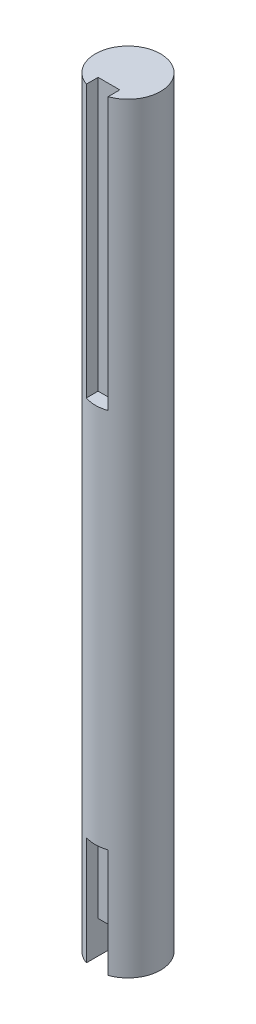
ISO-10303-21;
HEADER;
FILE_DESCRIPTION(('STEP AP214'),'2;1');
FILE_NAME('part.step','',(''),(''),'','','');
FILE_SCHEMA(('AUTOMOTIVE_DESIGN { 1 0 10303 214 1 1 1 1 }'));
ENDSEC;
DATA;
#1=APPLICATION_CONTEXT('core data for automotive mechanical design processes');
#2=APPLICATION_PROTOCOL_DEFINITION('international standard','automotive_design',2000,#1);
#3=PRODUCT_CONTEXT('',#1,'mechanical');
#4=PRODUCT('Part','Part','',(#3));
#5=PRODUCT_RELATED_PRODUCT_CATEGORY('part','',(#4));
#6=PRODUCT_DEFINITION_FORMATION('','',#4);
#7=PRODUCT_DEFINITION_CONTEXT('part definition',#1,'design');
#8=PRODUCT_DEFINITION('design','',#6,#7);
#9=PRODUCT_DEFINITION_SHAPE('','',#8);
#10=(LENGTH_UNIT() NAMED_UNIT(*) SI_UNIT(.MILLI.,.METRE.));
#11=(NAMED_UNIT(*) PLANE_ANGLE_UNIT() SI_UNIT($,.RADIAN.));
#12=(NAMED_UNIT(*) SI_UNIT($,.STERADIAN.) SOLID_ANGLE_UNIT());
#13=UNCERTAINTY_MEASURE_WITH_UNIT(LENGTH_MEASURE(1.E-05),#10,'distance_accuracy_value','');
#14=(GEOMETRIC_REPRESENTATION_CONTEXT(3) GLOBAL_UNCERTAINTY_ASSIGNED_CONTEXT((#13)) GLOBAL_UNIT_ASSIGNED_CONTEXT((#10,
#11,#12)) REPRESENTATION_CONTEXT('',''));
#15=CARTESIAN_POINT('',(0.,0.,0.));
#16=DIRECTION('',(0.,0.,1.));
#17=DIRECTION('',(1.,0.,0.));
#18=AXIS2_PLACEMENT_3D('',#15,#16,#17);
#19=CARTESIAN_POINT('',(0.,-36.,0.));
#20=DIRECTION('',(0.,1.,0.));
#21=DIRECTION('',(0.,0.,1.));
#22=AXIS2_PLACEMENT_3D('',#19,#20,#21);
#23=PLANE('',#22);
#24=DIRECTION('',(0.,0.,1.));
#25=VECTOR('',#24,1.);
#26=CARTESIAN_POINT('',(2.,-36.,0.));
#27=LINE('',#26,#25);
#28=CARTESIAN_POINT('',(2.,-36.,1.));
#29=VERTEX_POINT('',#28);
#30=CARTESIAN_POINT('',(2.,-36.,5.65685424949238));
#31=VERTEX_POINT('',#30);
#32=EDGE_CURVE('E186',#29,#31,#27,.T.);
#33=ORIENTED_EDGE('',*,*,#32,.F.);
#34=DIRECTION('',(-1.,0.,0.));
#35=VECTOR('',#34,1.);
#36=CARTESIAN_POINT('',(0.,-36.,1.));
#37=LINE('',#36,#35);
#38=CARTESIAN_POINT('',(-2.,-36.,0.999999999999999));
#39=VERTEX_POINT('',#38);
#40=EDGE_CURVE('E123',#29,#39,#37,.T.);
#41=ORIENTED_EDGE('',*,*,#40,.T.);
#42=DIRECTION('',(0.,0.,-1.));
#43=VECTOR('',#42,1.);
#44=CARTESIAN_POINT('',(-2.,-36.,0.));
#45=LINE('',#44,#43);
#46=CARTESIAN_POINT('',(-2.,-36.,5.65685424949238));
#47=VERTEX_POINT('',#46);
#48=EDGE_CURVE('E184',#47,#39,#45,.T.);
#49=ORIENTED_EDGE('',*,*,#48,.F.);
#50=CARTESIAN_POINT('',(0.,-36.,0.));
#51=DIRECTION('',(0.,1.,0.));
#52=DIRECTION('',(0.,0.,1.));
#53=AXIS2_PLACEMENT_3D('',#50,#51,#52);
#54=CIRCLE('',#53,6.);
#55=EDGE_CURVE('E181',#31,#47,#54,.T.);
#56=ORIENTED_EDGE('',*,*,#55,.F.);
#57=EDGE_LOOP('',(#33,#41,#49,#56));
#58=FACE_BOUND('',#57,.T.);
#59=ADVANCED_FACE('F38',(#58),#23,.F.);
#60=CARTESIAN_POINT('',(0.,-36.,0.));
#61=DIRECTION('',(0.,1.,0.));
#62=DIRECTION('',(0.,0.,1.));
#63=AXIS2_PLACEMENT_3D('',#60,#61,#62);
#64=CYLINDRICAL_SURFACE('',#63,6.);
#65=CARTESIAN_POINT('',(0.,-16.,0.));
#66=DIRECTION('',(0.,1.,0.));
#67=DIRECTION('',(0.,0.,1.));
#68=AXIS2_PLACEMENT_3D('',#65,#66,#67);
#69=CIRCLE('',#68,6.);
#70=CARTESIAN_POINT('',(2.,-16.,5.65685424949238));
#71=VERTEX_POINT('',#70);
#72=CARTESIAN_POINT('',(-2.,-16.,5.65685424949238));
#73=VERTEX_POINT('',#72);
#74=EDGE_CURVE('E188',#71,#73,#69,.F.);
#75=ORIENTED_EDGE('',*,*,#74,.F.);
#76=DIRECTION('',(0.,1.,0.));
#77=VECTOR('',#76,1.);
#78=CARTESIAN_POINT('',(2.,-36.,5.65685424949238));
#79=LINE('',#78,#77);
#80=EDGE_CURVE('E176',#71,#31,#79,.F.);
#81=ORIENTED_EDGE('',*,*,#80,.T.);
#82=ORIENTED_EDGE('',*,*,#55,.T.);
#83=DIRECTION('',(0.,1.,0.));
#84=VECTOR('',#83,1.);
#85=CARTESIAN_POINT('',(-2.,-36.,5.65685424949238));
#86=LINE('',#85,#84);
#87=EDGE_CURVE('E174',#47,#73,#86,.T.);
#88=ORIENTED_EDGE('',*,*,#87,.T.);
#89=EDGE_LOOP('',(#75,#81,#82,#88));
#90=FACE_BOUND('',#89,.T.);
#91=CARTESIAN_POINT('',(0.,54.,0.));
#92=DIRECTION('',(0.,-1.,0.));
#93=DIRECTION('',(0.,0.,-1.));
#94=AXIS2_PLACEMENT_3D('',#91,#92,#93);
#95=CIRCLE('',#94,6.);
#96=CARTESIAN_POINT('',(-2.,54.,5.65685424949238));
#97=VERTEX_POINT('',#96);
#98=CARTESIAN_POINT('',(2.,54.,5.65685424949238));
#99=VERTEX_POINT('',#98);
#100=EDGE_CURVE('E11',#97,#99,#95,.F.);
#101=ORIENTED_EDGE('',*,*,#100,.F.);
#102=DIRECTION('',(0.,1.,0.));
#103=VECTOR('',#102,1.);
#104=CARTESIAN_POINT('',(-2.,-36.,5.65685424949238));
#105=LINE('',#104,#103);
#106=CARTESIAN_POINT('',(-2.,104.,5.65685424949238));
#107=VERTEX_POINT('',#106);
#108=EDGE_CURVE('E160',#97,#107,#105,.T.);
#109=ORIENTED_EDGE('',*,*,#108,.T.);
#110=CARTESIAN_POINT('',(0.,104.,0.));
#111=DIRECTION('',(0.,1.,0.));
#112=DIRECTION('',(0.,0.,1.));
#113=AXIS2_PLACEMENT_3D('',#110,#111,#112);
#114=CIRCLE('',#113,6.);
#115=CARTESIAN_POINT('',(2.,104.,5.65685424949238));
#116=VERTEX_POINT('',#115);
#117=EDGE_CURVE('E178',#116,#107,#114,.T.);
#118=ORIENTED_EDGE('',*,*,#117,.F.);
#119=DIRECTION('',(0.,1.,0.));
#120=VECTOR('',#119,1.);
#121=CARTESIAN_POINT('',(2.,-36.,5.65685424949238));
#122=LINE('',#121,#120);
#123=EDGE_CURVE('E61',#116,#99,#122,.F.);
#124=ORIENTED_EDGE('',*,*,#123,.T.);
#125=EDGE_LOOP('',(#101,#109,#118,#124));
#126=FACE_BOUND('',#125,.T.);
#127=ADVANCED_FACE('F40',(#90,#126),#64,.T.);
#128=CARTESIAN_POINT('',(0.,104.,0.));
#129=DIRECTION('',(0.,1.,0.));
#130=DIRECTION('',(0.,0.,1.));
#131=AXIS2_PLACEMENT_3D('',#128,#129,#130);
#132=PLANE('',#131);
#133=ORIENTED_EDGE('',*,*,#117,.T.);
#134=DIRECTION('',(0.,0.,-1.));
#135=VECTOR('',#134,1.);
#136=CARTESIAN_POINT('',(-2.,104.,0.));
#137=LINE('',#136,#135);
#138=CARTESIAN_POINT('',(-2.,104.,3.5));
#139=VERTEX_POINT('',#138);
#140=EDGE_CURVE('E46',#107,#139,#137,.T.);
#141=ORIENTED_EDGE('',*,*,#140,.T.);
#142=DIRECTION('',(1.,0.,0.));
#143=VECTOR('',#142,1.);
#144=CARTESIAN_POINT('',(0.,104.,3.5));
#145=LINE('',#144,#143);
#146=CARTESIAN_POINT('',(2.,104.,3.5));
#147=VERTEX_POINT('',#146);
#148=EDGE_CURVE('E139',#139,#147,#145,.T.);
#149=ORIENTED_EDGE('',*,*,#148,.T.);
#150=DIRECTION('',(0.,0.,1.));
#151=VECTOR('',#150,1.);
#152=CARTESIAN_POINT('',(2.,104.,0.));
#153=LINE('',#152,#151);
#154=EDGE_CURVE('E147',#147,#116,#153,.T.);
#155=ORIENTED_EDGE('',*,*,#154,.T.);
#156=EDGE_LOOP('',(#133,#141,#149,#155));
#157=FACE_BOUND('',#156,.T.);
#158=ADVANCED_FACE('F192',(#157),#132,.T.);
#159=CARTESIAN_POINT('',(0.,-16.,3.5));
#160=DIRECTION('',(0.,0.,1.));
#161=DIRECTION('',(1.,0.,0.));
#162=AXIS2_PLACEMENT_3D('',#159,#160,#161);
#163=PLANE('',#162);
#164=DIRECTION('',(-1.,0.,0.));
#165=VECTOR('',#164,1.);
#166=CARTESIAN_POINT('',(0.,-30.,3.5));
#167=LINE('',#166,#165);
#168=CARTESIAN_POINT('',(2.,-30.,3.5));
#169=VERTEX_POINT('',#168);
#170=CARTESIAN_POINT('',(-2.,-30.,3.5));
#171=VERTEX_POINT('',#170);
#172=EDGE_CURVE('E136',#169,#171,#167,.T.);
#173=ORIENTED_EDGE('',*,*,#172,.F.);
#174=DIRECTION('',(0.,-1.,0.));
#175=VECTOR('',#174,1.);
#176=CARTESIAN_POINT('',(2.,-16.,3.5));
#177=LINE('',#176,#175);
#178=CARTESIAN_POINT('',(2.,-16.,3.5));
#179=VERTEX_POINT('',#178);
#180=EDGE_CURVE('E121',#179,#169,#177,.T.);
#181=ORIENTED_EDGE('',*,*,#180,.F.);
#182=DIRECTION('',(-1.,0.,0.));
#183=VECTOR('',#182,1.);
#184=CARTESIAN_POINT('',(0.,-16.,3.5));
#185=LINE('',#184,#183);
#186=CARTESIAN_POINT('',(-2.,-16.,3.5));
#187=VERTEX_POINT('',#186);
#188=EDGE_CURVE('E165',#179,#187,#185,.T.);
#189=ORIENTED_EDGE('',*,*,#188,.T.);
#190=DIRECTION('',(0.,-1.,0.));
#191=VECTOR('',#190,1.);
#192=CARTESIAN_POINT('',(-2.,-16.,3.5));
#193=LINE('',#192,#191);
#194=EDGE_CURVE('E170',#187,#171,#193,.T.);
#195=ORIENTED_EDGE('',*,*,#194,.T.);
#196=EDGE_LOOP('',(#173,#181,#189,#195));
#197=FACE_BOUND('',#196,.T.);
#198=ADVANCED_FACE('F226',(#197),#163,.T.);
#199=CARTESIAN_POINT('',(2.,-16.,0.));
#200=DIRECTION('',(-1.,0.,0.));
#201=DIRECTION('',(0.,0.,1.));
#202=AXIS2_PLACEMENT_3D('',#199,#200,#201);
#203=PLANE('',#202);
#204=ORIENTED_EDGE('',*,*,#180,.T.);
#205=DIRECTION('',(0.,0.,-1.));
#206=VECTOR('',#205,1.);
#207=CARTESIAN_POINT('',(2.,-30.,0.));
#208=LINE('',#207,#206);
#209=CARTESIAN_POINT('',(2.,-30.,1.));
#210=VERTEX_POINT('',#209);
#211=EDGE_CURVE('E53',#169,#210,#208,.T.);
#212=ORIENTED_EDGE('',*,*,#211,.T.);
#213=DIRECTION('',(0.,-1.,0.));
#214=VECTOR('',#213,1.);
#215=CARTESIAN_POINT('',(2.,-30.,1.));
#216=LINE('',#215,#214);
#217=EDGE_CURVE('E119',#210,#29,#216,.T.);
#218=ORIENTED_EDGE('',*,*,#217,.T.);
#219=ORIENTED_EDGE('',*,*,#32,.T.);
#220=ORIENTED_EDGE('',*,*,#80,.F.);
#221=DIRECTION('',(0.,0.,-1.));
#222=VECTOR('',#221,1.);
#223=CARTESIAN_POINT('',(2.,-16.,0.));
#224=LINE('',#223,#222);
#225=EDGE_CURVE('E163',#71,#179,#224,.T.);
#226=ORIENTED_EDGE('',*,*,#225,.T.);
#227=EDGE_LOOP('',(#204,#212,#218,#219,#220,#226));
#228=FACE_BOUND('',#227,.T.);
#229=ADVANCED_FACE('F116',(#228),#203,.T.);
#230=CARTESIAN_POINT('',(-2.,-16.,0.));
#231=DIRECTION('',(1.,0.,0.));
#232=DIRECTION('',(0.,0.,-1.));
#233=AXIS2_PLACEMENT_3D('',#230,#231,#232);
#234=PLANE('',#233);
#235=DIRECTION('',(0.,0.,1.));
#236=VECTOR('',#235,1.);
#237=CARTESIAN_POINT('',(-2.,-16.,0.));
#238=LINE('',#237,#236);
#239=EDGE_CURVE('E167',#187,#73,#238,.T.);
#240=ORIENTED_EDGE('',*,*,#239,.T.);
#241=ORIENTED_EDGE('',*,*,#87,.F.);
#242=ORIENTED_EDGE('',*,*,#48,.T.);
#243=DIRECTION('',(0.,-1.,0.));
#244=VECTOR('',#243,1.);
#245=CARTESIAN_POINT('',(-2.,-30.,0.999999999999999));
#246=LINE('',#245,#244);
#247=CARTESIAN_POINT('',(-2.,-30.,0.999999999999999));
#248=VERTEX_POINT('',#247);
#249=EDGE_CURVE('E137',#248,#39,#246,.T.);
#250=ORIENTED_EDGE('',*,*,#249,.F.);
#251=DIRECTION('',(0.,0.,1.));
#252=VECTOR('',#251,1.);
#253=CARTESIAN_POINT('',(-2.,-30.,0.));
#254=LINE('',#253,#252);
#255=EDGE_CURVE('E128',#248,#171,#254,.T.);
#256=ORIENTED_EDGE('',*,*,#255,.T.);
#257=ORIENTED_EDGE('',*,*,#194,.F.);
#258=EDGE_LOOP('',(#240,#241,#242,#250,#256,#257));
#259=FACE_BOUND('',#258,.T.);
#260=ADVANCED_FACE('F229',(#259),#234,.T.);
#261=CARTESIAN_POINT('',(0.,-16.,0.));
#262=DIRECTION('',(0.,1.,0.));
#263=DIRECTION('',(0.,0.,1.));
#264=AXIS2_PLACEMENT_3D('',#261,#262,#263);
#265=PLANE('',#264);
#266=ORIENTED_EDGE('',*,*,#74,.T.);
#267=ORIENTED_EDGE('',*,*,#239,.F.);
#268=ORIENTED_EDGE('',*,*,#188,.F.);
#269=ORIENTED_EDGE('',*,*,#225,.F.);
#270=EDGE_LOOP('',(#266,#267,#268,#269));
#271=FACE_BOUND('',#270,.T.);
#272=ADVANCED_FACE('F215',(#271),#265,.F.);
#273=CARTESIAN_POINT('',(-2.,54.,0.));
#274=DIRECTION('',(1.,0.,0.));
#275=DIRECTION('',(0.,0.,-1.));
#276=AXIS2_PLACEMENT_3D('',#273,#274,#275);
#277=PLANE('',#276);
#278=DIRECTION('',(0.,0.,-1.));
#279=VECTOR('',#278,1.);
#280=CARTESIAN_POINT('',(-2.,54.,0.));
#281=LINE('',#280,#279);
#282=CARTESIAN_POINT('',(-2.,54.,3.5));
#283=VERTEX_POINT('',#282);
#284=EDGE_CURVE('E144',#97,#283,#281,.T.);
#285=ORIENTED_EDGE('',*,*,#284,.T.);
#286=DIRECTION('',(0.,1.,0.));
#287=VECTOR('',#286,1.);
#288=CARTESIAN_POINT('',(-2.,54.,3.5));
#289=LINE('',#288,#287);
#290=EDGE_CURVE('E156',#283,#139,#289,.T.);
#291=ORIENTED_EDGE('',*,*,#290,.T.);
#292=ORIENTED_EDGE('',*,*,#140,.F.);
#293=ORIENTED_EDGE('',*,*,#108,.F.);
#294=EDGE_LOOP('',(#285,#291,#292,#293));
#295=FACE_BOUND('',#294,.T.);
#296=ADVANCED_FACE('F195',(#295),#277,.T.);
#297=CARTESIAN_POINT('',(0.,54.,3.5));
#298=DIRECTION('',(0.,0.,1.));
#299=DIRECTION('',(1.,0.,0.));
#300=AXIS2_PLACEMENT_3D('',#297,#298,#299);
#301=PLANE('',#300);
#302=ORIENTED_EDGE('',*,*,#148,.F.);
#303=ORIENTED_EDGE('',*,*,#290,.F.);
#304=DIRECTION('',(1.,0.,0.));
#305=VECTOR('',#304,1.);
#306=CARTESIAN_POINT('',(0.,54.,3.5));
#307=LINE('',#306,#305);
#308=CARTESIAN_POINT('',(2.,54.,3.5));
#309=VERTEX_POINT('',#308);
#310=EDGE_CURVE('E146',#283,#309,#307,.T.);
#311=ORIENTED_EDGE('',*,*,#310,.T.);
#312=DIRECTION('',(0.,1.,0.));
#313=VECTOR('',#312,1.);
#314=CARTESIAN_POINT('',(2.,54.,3.5));
#315=LINE('',#314,#313);
#316=EDGE_CURVE('E151',#309,#147,#315,.T.);
#317=ORIENTED_EDGE('',*,*,#316,.T.);
#318=EDGE_LOOP('',(#302,#303,#311,#317));
#319=FACE_BOUND('',#318,.T.);
#320=ADVANCED_FACE('F207',(#319),#301,.T.);
#321=CARTESIAN_POINT('',(2.,54.,0.));
#322=DIRECTION('',(-1.,0.,0.));
#323=DIRECTION('',(0.,0.,1.));
#324=AXIS2_PLACEMENT_3D('',#321,#322,#323);
#325=PLANE('',#324);
#326=ORIENTED_EDGE('',*,*,#154,.F.);
#327=ORIENTED_EDGE('',*,*,#316,.F.);
#328=DIRECTION('',(0.,0.,1.));
#329=VECTOR('',#328,1.);
#330=CARTESIAN_POINT('',(2.,54.,0.));
#331=LINE('',#330,#329);
#332=EDGE_CURVE('E149',#309,#99,#331,.T.);
#333=ORIENTED_EDGE('',*,*,#332,.T.);
#334=ORIENTED_EDGE('',*,*,#123,.F.);
#335=EDGE_LOOP('',(#326,#327,#333,#334));
#336=FACE_BOUND('',#335,.T.);
#337=ADVANCED_FACE('F205',(#336),#325,.T.);
#338=CARTESIAN_POINT('',(0.,54.,0.));
#339=DIRECTION('',(0.,-1.,0.));
#340=DIRECTION('',(0.,0.,-1.));
#341=AXIS2_PLACEMENT_3D('',#338,#339,#340);
#342=PLANE('',#341);
#343=ORIENTED_EDGE('',*,*,#100,.T.);
#344=ORIENTED_EDGE('',*,*,#332,.F.);
#345=ORIENTED_EDGE('',*,*,#310,.F.);
#346=ORIENTED_EDGE('',*,*,#284,.F.);
#347=EDGE_LOOP('',(#343,#344,#345,#346));
#348=FACE_BOUND('',#347,.T.);
#349=ADVANCED_FACE('F202',(#348),#342,.F.);
#350=CARTESIAN_POINT('',(0.,-30.,1.));
#351=DIRECTION('',(0.,0.,1.));
#352=DIRECTION('',(1.,0.,0.));
#353=AXIS2_PLACEMENT_3D('',#350,#351,#352);
#354=PLANE('',#353);
#355=ORIENTED_EDGE('',*,*,#40,.F.);
#356=ORIENTED_EDGE('',*,*,#217,.F.);
#357=DIRECTION('',(-1.,0.,0.));
#358=VECTOR('',#357,1.);
#359=CARTESIAN_POINT('',(0.,-30.,1.));
#360=LINE('',#359,#358);
#361=EDGE_CURVE('E122',#210,#248,#360,.T.);
#362=ORIENTED_EDGE('',*,*,#361,.T.);
#363=ORIENTED_EDGE('',*,*,#249,.T.);
#364=EDGE_LOOP('',(#355,#356,#362,#363));
#365=FACE_BOUND('',#364,.T.);
#366=ADVANCED_FACE('F134',(#365),#354,.T.);
#367=CARTESIAN_POINT('',(0.,-30.,0.));
#368=DIRECTION('',(0.,1.,0.));
#369=DIRECTION('',(0.,0.,1.));
#370=AXIS2_PLACEMENT_3D('',#367,#368,#369);
#371=PLANE('',#370);
#372=ORIENTED_EDGE('',*,*,#172,.T.);
#373=ORIENTED_EDGE('',*,*,#255,.F.);
#374=ORIENTED_EDGE('',*,*,#361,.F.);
#375=ORIENTED_EDGE('',*,*,#211,.F.);
#376=EDGE_LOOP('',(#372,#373,#374,#375));
#377=FACE_BOUND('',#376,.T.);
#378=ADVANCED_FACE('F126',(#377),#371,.F.);
#379=CLOSED_SHELL('',(#59,#127,#158,#198,#229,#260,#272,#296,#320,#337,#349,#366,#378));
#380=MANIFOLD_SOLID_BREP('B2',#379);
#381=ADVANCED_BREP_SHAPE_REPRESENTATION('',(#18,#380),#14);
#382=SHAPE_DEFINITION_REPRESENTATION(#9,#381);
ENDSEC;
END-ISO-10303-21;
